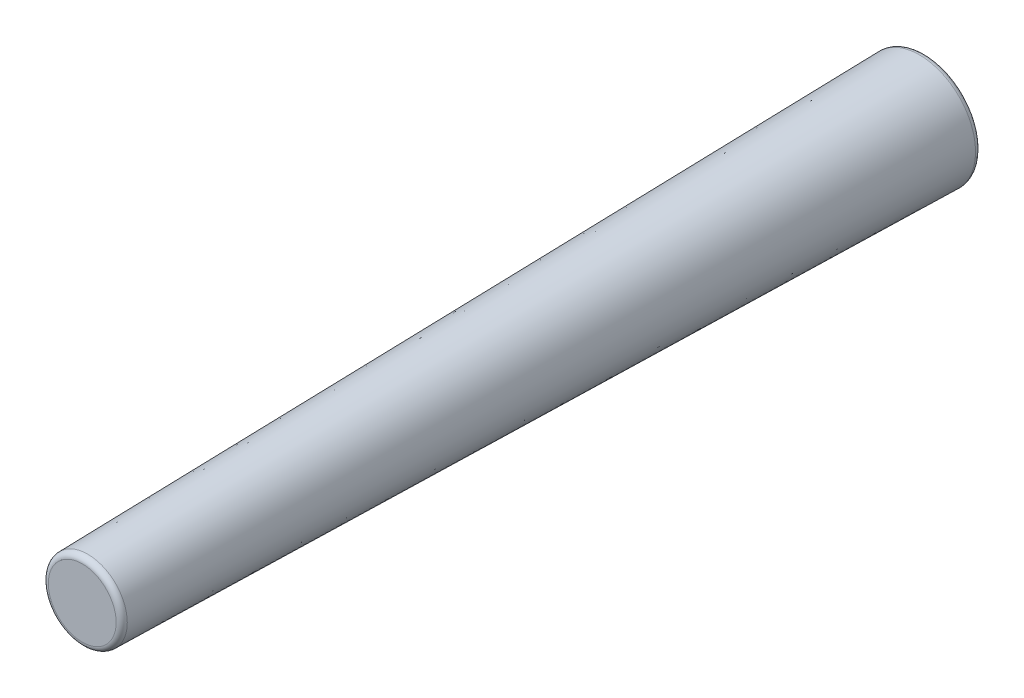
ISO-10303-21;
HEADER;
FILE_DESCRIPTION(('STEP AP214'),'2;1');
FILE_NAME('part.step','',(''),(''),'','','');
FILE_SCHEMA(('AUTOMOTIVE_DESIGN { 1 0 10303 214 1 1 1 1 }'));
ENDSEC;
DATA;
#1=APPLICATION_CONTEXT('core data for automotive mechanical design processes');
#2=APPLICATION_PROTOCOL_DEFINITION('international standard','automotive_design',2000,#1);
#3=PRODUCT_CONTEXT('',#1,'mechanical');
#4=PRODUCT('Part','Part','',(#3));
#5=PRODUCT_RELATED_PRODUCT_CATEGORY('part','',(#4));
#6=PRODUCT_DEFINITION_FORMATION('','',#4);
#7=PRODUCT_DEFINITION_CONTEXT('part definition',#1,'design');
#8=PRODUCT_DEFINITION('design','',#6,#7);
#9=PRODUCT_DEFINITION_SHAPE('','',#8);
#10=(LENGTH_UNIT() NAMED_UNIT(*) SI_UNIT(.MILLI.,.METRE.));
#11=(NAMED_UNIT(*) PLANE_ANGLE_UNIT() SI_UNIT($,.RADIAN.));
#12=(NAMED_UNIT(*) SI_UNIT($,.STERADIAN.) SOLID_ANGLE_UNIT());
#13=UNCERTAINTY_MEASURE_WITH_UNIT(LENGTH_MEASURE(1.E-05),#10,'distance_accuracy_value','');
#14=(GEOMETRIC_REPRESENTATION_CONTEXT(3) GLOBAL_UNCERTAINTY_ASSIGNED_CONTEXT((#13)) GLOBAL_UNIT_ASSIGNED_CONTEXT((#10,
#11,#12)) REPRESENTATION_CONTEXT('',''));
#15=CARTESIAN_POINT('',(0.,0.,0.));
#16=DIRECTION('',(0.,0.,1.));
#17=DIRECTION('',(1.,0.,0.));
#18=AXIS2_PLACEMENT_3D('',#15,#16,#17);
#19=CARTESIAN_POINT('',(0.,0.,0.));
#20=DIRECTION('',(0.,0.,-1.));
#21=DIRECTION('',(1.,0.,0.));
#22=AXIS2_PLACEMENT_3D('',#19,#20,#21);
#23=CONICAL_SURFACE('',#22,1.,0.0198967534727354);
#24=CARTESIAN_POINT('',(0.,0.,0.101989544070827));
#25=DIRECTION('',(0.,0.,1.));
#26=DIRECTION('',(1.,0.,0.));
#27=AXIS2_PLACEMENT_3D('',#24,#25,#26);
#28=CIRCLE('',#27,0.997970471360618);
#29=CARTESIAN_POINT('',(0.997970471360618,0.,0.101989544070827));
#30=VERTEX_POINT('',#29);
#31=EDGE_CURVE('E43',#30,#30,#28,.T.);
#32=ORIENTED_EDGE('',*,*,#31,.T.);
#33=EDGE_LOOP('',(#32));
#34=FACE_BOUND('',#33,.T.);
#35=CARTESIAN_POINT('',(0.,0.,14.9019895440708));
#36=DIRECTION('',(0.,0.,-1.));
#37=DIRECTION('',(-1.,0.,0.));
#38=AXIS2_PLACEMENT_3D('',#35,#36,#37);
#39=CIRCLE('',#38,0.703459655212689);
#40=CARTESIAN_POINT('',(-0.703459655212689,0.,14.9019895440708));
#41=VERTEX_POINT('',#40);
#42=EDGE_CURVE('E47',#41,#41,#39,.T.);
#43=ORIENTED_EDGE('',*,*,#42,.T.);
#44=EDGE_LOOP('',(#43));
#45=FACE_BOUND('',#44,.T.);
#46=ADVANCED_FACE('F32',(#34,#45),#23,.T.);
#47=CARTESIAN_POINT('',(0.,0.,15.));
#48=DIRECTION('',(0.,0.,1.));
#49=DIRECTION('',(1.,0.,0.));
#50=AXIS2_PLACEMENT_3D('',#47,#48,#49);
#51=PLANE('',#50);
#52=CARTESIAN_POINT('',(0.,0.,15.));
#53=DIRECTION('',(0.,0.,1.));
#54=DIRECTION('',(1.,0.,0.));
#55=AXIS2_PLACEMENT_3D('',#52,#53,#54);
#56=CIRCLE('',#55,0.603479448599629);
#57=CARTESIAN_POINT('',(0.603479448599629,0.,15.));
#58=VERTEX_POINT('',#57);
#59=EDGE_CURVE('E10',#58,#58,#56,.T.);
#60=ORIENTED_EDGE('',*,*,#59,.T.);
#61=EDGE_LOOP('',(#60));
#62=FACE_BOUND('',#61,.T.);
#63=ADVANCED_FACE('F63',(#62),#51,.T.);
#64=CARTESIAN_POINT('',(0.,0.,0.));
#65=DIRECTION('',(0.,0.,1.));
#66=DIRECTION('',(1.,0.,0.));
#67=AXIS2_PLACEMENT_3D('',#64,#65,#66);
#68=PLANE('',#67);
#69=CARTESIAN_POINT('',(0.,0.,0.));
#70=DIRECTION('',(0.,0.,1.));
#71=DIRECTION('',(1.,0.,0.));
#72=AXIS2_PLACEMENT_3D('',#69,#70,#71);
#73=CIRCLE('',#72,0.897990264747557);
#74=CARTESIAN_POINT('',(0.897990264747557,0.,0.));
#75=VERTEX_POINT('',#74);
#76=EDGE_CURVE('E39',#75,#75,#73,.F.);
#77=ORIENTED_EDGE('',*,*,#76,.T.);
#78=EDGE_LOOP('',(#77));
#79=FACE_BOUND('',#78,.T.);
#80=ADVANCED_FACE('F60',(#79),#68,.F.);
#81=CARTESIAN_POINT('',(0.,0.,0.1));
#82=DIRECTION('',(0.,0.,1.));
#83=DIRECTION('',(1.,0.,0.));
#84=AXIS2_PLACEMENT_3D('',#81,#82,#83);
#85=TOROIDAL_SURFACE('',#84,0.897990264747557,0.1);
#86=ORIENTED_EDGE('',*,*,#76,.F.);
#87=EDGE_LOOP('',(#86));
#88=FACE_BOUND('',#87,.T.);
#89=ORIENTED_EDGE('',*,*,#31,.F.);
#90=EDGE_LOOP('',(#89));
#91=FACE_BOUND('',#90,.T.);
#92=ADVANCED_FACE('F56',(#88,#91),#85,.T.);
#93=CARTESIAN_POINT('',(0.,0.,14.9));
#94=DIRECTION('',(0.,0.,1.));
#95=DIRECTION('',(1.,0.,0.));
#96=AXIS2_PLACEMENT_3D('',#93,#94,#95);
#97=TOROIDAL_SURFACE('',#96,0.603479448599629,0.1);
#98=ORIENTED_EDGE('',*,*,#42,.F.);
#99=EDGE_LOOP('',(#98));
#100=FACE_BOUND('',#99,.T.);
#101=ORIENTED_EDGE('',*,*,#59,.F.);
#102=EDGE_LOOP('',(#101));
#103=FACE_BOUND('',#102,.T.);
#104=ADVANCED_FACE('F34',(#100,#103),#97,.T.);
#105=CLOSED_SHELL('',(#46,#63,#80,#92,#104));
#106=MANIFOLD_SOLID_BREP('B2',#105);
#107=ADVANCED_BREP_SHAPE_REPRESENTATION('',(#18,#106),#14);
#108=SHAPE_DEFINITION_REPRESENTATION(#9,#107);
ENDSEC;
END-ISO-10303-21;
